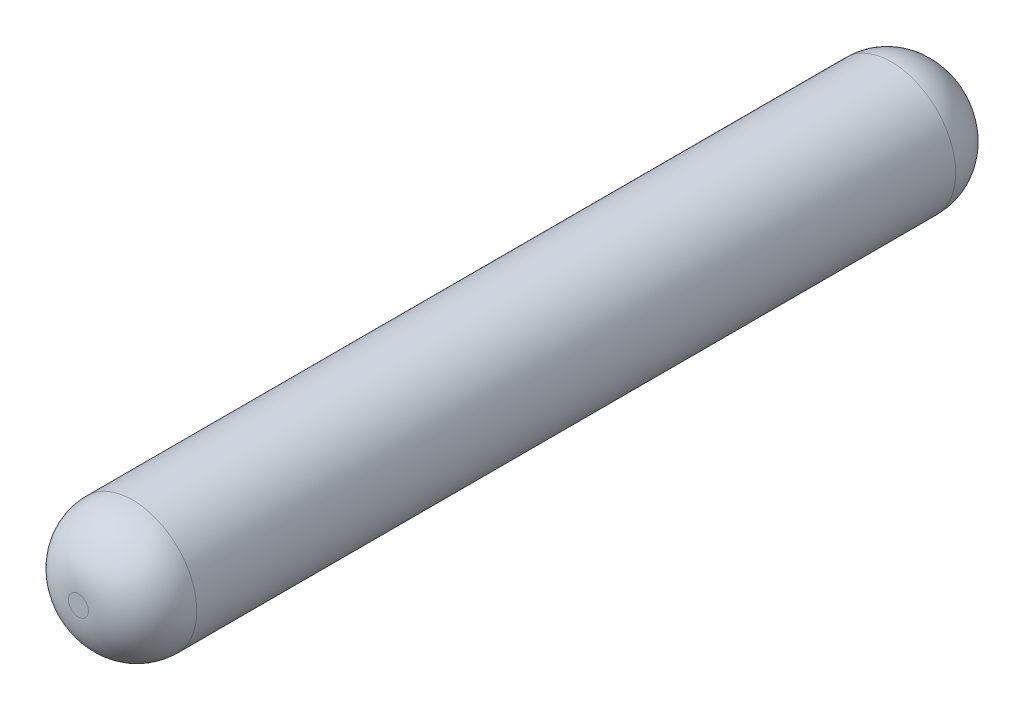
ISO-10303-21;
HEADER;
FILE_DESCRIPTION(('STEP AP214'),'2;1');
FILE_NAME('part.step','',(''),(''),'','','');
FILE_SCHEMA(('AUTOMOTIVE_DESIGN { 1 0 10303 214 1 1 1 1 }'));
ENDSEC;
DATA;
#1=APPLICATION_CONTEXT('core data for automotive mechanical design processes');
#2=APPLICATION_PROTOCOL_DEFINITION('international standard','automotive_design',2000,#1);
#3=PRODUCT_CONTEXT('',#1,'mechanical');
#4=PRODUCT('Part','Part','',(#3));
#5=PRODUCT_RELATED_PRODUCT_CATEGORY('part','',(#4));
#6=PRODUCT_DEFINITION_FORMATION('','',#4);
#7=PRODUCT_DEFINITION_CONTEXT('part definition',#1,'design');
#8=PRODUCT_DEFINITION('design','',#6,#7);
#9=PRODUCT_DEFINITION_SHAPE('','',#8);
#10=(LENGTH_UNIT() NAMED_UNIT(*) SI_UNIT(.MILLI.,.METRE.));
#11=(NAMED_UNIT(*) PLANE_ANGLE_UNIT() SI_UNIT($,.RADIAN.));
#12=(NAMED_UNIT(*) SI_UNIT($,.STERADIAN.) SOLID_ANGLE_UNIT());
#13=UNCERTAINTY_MEASURE_WITH_UNIT(LENGTH_MEASURE(1.E-05),#10,'distance_accuracy_value','');
#14=(GEOMETRIC_REPRESENTATION_CONTEXT(3) GLOBAL_UNCERTAINTY_ASSIGNED_CONTEXT((#13)) GLOBAL_UNIT_ASSIGNED_CONTEXT((#10,
#11,#12)) REPRESENTATION_CONTEXT('',''));
#15=CARTESIAN_POINT('',(0.,0.,0.));
#16=DIRECTION('',(0.,0.,1.));
#17=DIRECTION('',(1.,0.,0.));
#18=AXIS2_PLACEMENT_3D('',#15,#16,#17);
#19=CARTESIAN_POINT('',(0.,7.02627500000001,10.16));
#20=DIRECTION('',(0.,0.,1.));
#21=DIRECTION('',(1.,0.,0.));
#22=AXIS2_PLACEMENT_3D('',#19,#20,#21);
#23=PLANE('',#22);
#24=CARTESIAN_POINT('',(0.,7.02627500000001,10.16));
#25=DIRECTION('',(0.,0.,-1.));
#26=DIRECTION('',(-1.,0.,0.));
#27=AXIS2_PLACEMENT_3D('',#24,#25,#26);
#28=CIRCLE('',#27,0.117475000000008);
#29=CARTESIAN_POINT('',(-0.117475000000085,7.02627500000001,10.16));
#30=VERTEX_POINT('',#29);
#31=CARTESIAN_POINT('',(0.117474999999932,7.02627500000001,10.16));
#32=VERTEX_POINT('',#31);
#33=EDGE_CURVE('E49',#30,#32,#28,.T.);
#34=ORIENTED_EDGE('',*,*,#33,.F.);
#35=CARTESIAN_POINT('',(0.,7.02627500000001,10.16));
#36=DIRECTION('',(0.,0.,-1.));
#37=DIRECTION('',(1.,0.,0.));
#38=AXIS2_PLACEMENT_3D('',#35,#36,#37);
#39=CIRCLE('',#38,0.117475000000008);
#40=EDGE_CURVE('E45',#32,#30,#39,.T.);
#41=ORIENTED_EDGE('',*,*,#40,.F.);
#42=EDGE_LOOP('',(#34,#41));
#43=FACE_BOUND('',#42,.T.);
#44=ADVANCED_FACE('F16',(#43),#23,.T.);
#45=CARTESIAN_POINT('',(0.,7.02627500000001,0.));
#46=DIRECTION('',(0.,0.,1.));
#47=DIRECTION('',(1.,0.,0.));
#48=AXIS2_PLACEMENT_3D('',#45,#46,#47);
#49=PLANE('',#48);
#50=CARTESIAN_POINT('',(0.,7.02627500000001,0.));
#51=DIRECTION('',(0.,0.,1.));
#52=DIRECTION('',(1.,0.,0.));
#53=AXIS2_PLACEMENT_3D('',#50,#51,#52);
#54=CIRCLE('',#53,0.117475000000008);
#55=CARTESIAN_POINT('',(0.117474999999932,7.02627500000001,0.));
#56=VERTEX_POINT('',#55);
#57=CARTESIAN_POINT('',(-0.117475000000085,7.02627500000001,0.));
#58=VERTEX_POINT('',#57);
#59=EDGE_CURVE('E56',#56,#58,#54,.T.);
#60=ORIENTED_EDGE('',*,*,#59,.F.);
#61=CARTESIAN_POINT('',(0.,7.02627500000001,0.));
#62=DIRECTION('',(0.,0.,1.));
#63=DIRECTION('',(-1.,0.,0.));
#64=AXIS2_PLACEMENT_3D('',#61,#62,#63);
#65=CIRCLE('',#64,0.117475000000008);
#66=EDGE_CURVE('E36',#58,#56,#65,.T.);
#67=ORIENTED_EDGE('',*,*,#66,.F.);
#68=EDGE_LOOP('',(#60,#67));
#69=FACE_BOUND('',#68,.T.);
#70=ADVANCED_FACE('F74',(#69),#49,.F.);
#71=CARTESIAN_POINT('',(0.117474999999932,7.02627500000001,9.525));
#72=DIRECTION('',(0.,1.,0.));
#73=DIRECTION('',(1.,0.,0.));
#74=AXIS2_PLACEMENT_3D('',#71,#72,#73);
#75=CIRCLE('',#74,0.635);
#76=TRIMMED_CURVE('',#75,(PARAMETER_VALUE(-1.75686818912583)),
(PARAMETER_VALUE(1.75686818912583)),.T.,.PARAMETER.);
#77=CARTESIAN_POINT('',(0.,7.02627500000001,9.525));
#78=DIRECTION('',(0.,0.,1.));
#79=AXIS1_PLACEMENT('',#77,#78);
#80=SURFACE_OF_REVOLUTION('',#76,#79);
#81=ORIENTED_EDGE('',*,*,#40,.T.);
#82=ORIENTED_EDGE('',*,*,#33,.T.);
#83=EDGE_LOOP('',(#81,#82));
#84=FACE_BOUND('',#83,.T.);
#85=CARTESIAN_POINT('',(0.,7.02627500000001,9.525));
#86=DIRECTION('',(0.,0.,-1.));
#87=DIRECTION('',(-1.,0.,0.));
#88=AXIS2_PLACEMENT_3D('',#85,#86,#87);
#89=CIRCLE('',#88,0.752475000000008);
#90=CARTESIAN_POINT('',(-0.752475000000085,7.02627500000001,9.525));
#91=VERTEX_POINT('',#90);
#92=EDGE_CURVE('E28',#91,#91,#89,.T.);
#93=ORIENTED_EDGE('',*,*,#92,.F.);
#94=EDGE_LOOP('',(#93));
#95=FACE_BOUND('',#94,.T.);
#96=ADVANCED_FACE('F54',(#84,#95),#80,.F.);
#97=CARTESIAN_POINT('',(0.117474999999932,7.02627500000001,0.635));
#98=DIRECTION('',(0.,1.,0.));
#99=DIRECTION('',(1.,0.,0.));
#100=AXIS2_PLACEMENT_3D('',#97,#98,#99);
#101=CIRCLE('',#100,0.635);
#102=TRIMMED_CURVE('',#101,(PARAMETER_VALUE(-1.75686818912583)),
(PARAMETER_VALUE(1.75686818912583)),.T.,.PARAMETER.);
#103=CARTESIAN_POINT('',(0.,7.02627500000001,0.635));
#104=DIRECTION('',(0.,0.,1.));
#105=AXIS1_PLACEMENT('',#103,#104);
#106=SURFACE_OF_REVOLUTION('',#102,#105);
#107=CARTESIAN_POINT('',(0.,7.02627500000001,0.635));
#108=DIRECTION('',(0.,0.,-1.));
#109=DIRECTION('',(-1.,0.,0.));
#110=AXIS2_PLACEMENT_3D('',#107,#108,#109);
#111=CIRCLE('',#110,0.752475000000008);
#112=CARTESIAN_POINT('',(-0.752475000000085,7.02627500000001,0.635));
#113=VERTEX_POINT('',#112);
#114=EDGE_CURVE('E11',#113,#113,#111,.F.);
#115=ORIENTED_EDGE('',*,*,#114,.F.);
#116=EDGE_LOOP('',(#115));
#117=FACE_BOUND('',#116,.T.);
#118=ORIENTED_EDGE('',*,*,#59,.T.);
#119=ORIENTED_EDGE('',*,*,#66,.T.);
#120=EDGE_LOOP('',(#118,#119));
#121=FACE_BOUND('',#120,.T.);
#122=ADVANCED_FACE('F73',(#117,#121),#106,.F.);
#123=CARTESIAN_POINT('',(0.,7.02627500000001,10.16));
#124=DIRECTION('',(0.,0.,-1.));
#125=DIRECTION('',(-1.,0.,0.));
#126=AXIS2_PLACEMENT_3D('',#123,#124,#125);
#127=CYLINDRICAL_SURFACE('',#126,0.752475000000008);
#128=ORIENTED_EDGE('',*,*,#114,.T.);
#129=EDGE_LOOP('',(#128));
#130=FACE_BOUND('',#129,.T.);
#131=ORIENTED_EDGE('',*,*,#92,.T.);
#132=EDGE_LOOP('',(#131));
#133=FACE_BOUND('',#132,.T.);
#134=ADVANCED_FACE('F119',(#130,#133),#127,.T.);
#135=CLOSED_SHELL('',(#44,#70,#96,#122,#134));
#136=MANIFOLD_SOLID_BREP('B1',#135);
#137=ADVANCED_BREP_SHAPE_REPRESENTATION('',(#18,#136),#14);
#138=SHAPE_DEFINITION_REPRESENTATION(#9,#137);
ENDSEC;
END-ISO-10303-21;
